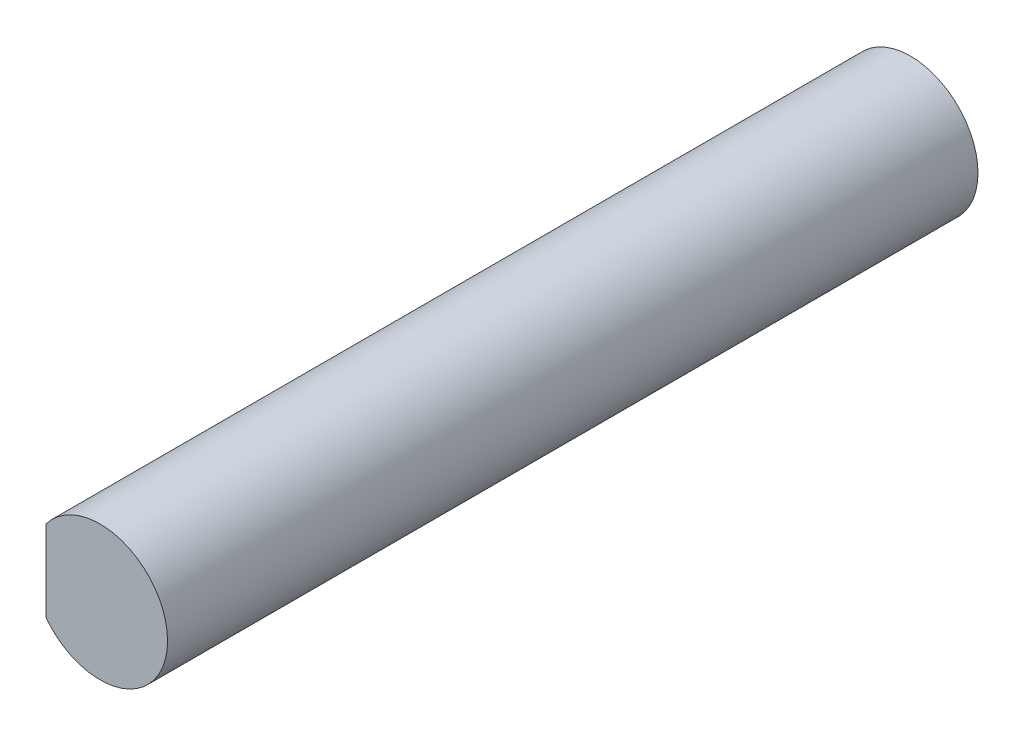
ISO-10303-21;
HEADER;
FILE_DESCRIPTION(('STEP AP214'),'2;1');
FILE_NAME('part.step','',(''),(''),'','','');
FILE_SCHEMA(('AUTOMOTIVE_DESIGN { 1 0 10303 214 1 1 1 1 }'));
ENDSEC;
DATA;
#1=APPLICATION_CONTEXT('core data for automotive mechanical design processes');
#2=APPLICATION_PROTOCOL_DEFINITION('international standard','automotive_design',2000,#1);
#3=PRODUCT_CONTEXT('',#1,'mechanical');
#4=PRODUCT('Part','Part','',(#3));
#5=PRODUCT_RELATED_PRODUCT_CATEGORY('part','',(#4));
#6=PRODUCT_DEFINITION_FORMATION('','',#4);
#7=PRODUCT_DEFINITION_CONTEXT('part definition',#1,'design');
#8=PRODUCT_DEFINITION('design','',#6,#7);
#9=PRODUCT_DEFINITION_SHAPE('','',#8);
#10=(LENGTH_UNIT() NAMED_UNIT(*) SI_UNIT(.MILLI.,.METRE.));
#11=(NAMED_UNIT(*) PLANE_ANGLE_UNIT() SI_UNIT($,.RADIAN.));
#12=(NAMED_UNIT(*) SI_UNIT($,.STERADIAN.) SOLID_ANGLE_UNIT());
#13=UNCERTAINTY_MEASURE_WITH_UNIT(LENGTH_MEASURE(1.E-05),#10,'distance_accuracy_value','');
#14=(GEOMETRIC_REPRESENTATION_CONTEXT(3) GLOBAL_UNCERTAINTY_ASSIGNED_CONTEXT((#13)) GLOBAL_UNIT_ASSIGNED_CONTEXT((#10,
#11,#12)) REPRESENTATION_CONTEXT('',''));
#15=CARTESIAN_POINT('',(0.,0.,0.));
#16=DIRECTION('',(0.,0.,1.));
#17=DIRECTION('',(1.,0.,0.));
#18=AXIS2_PLACEMENT_3D('',#15,#16,#17);
#19=CARTESIAN_POINT('',(0.,0.,70.));
#20=DIRECTION('',(0.,0.,-1.));
#21=DIRECTION('',(-1.,0.,0.));
#22=AXIS2_PLACEMENT_3D('',#19,#20,#21);
#23=CYLINDRICAL_SURFACE('',#22,5.);
#24=CARTESIAN_POINT('',(0.,0.,70.));
#25=DIRECTION('',(0.,0.,1.));
#26=DIRECTION('',(1.,0.,0.));
#27=AXIS2_PLACEMENT_3D('',#24,#25,#26);
#28=CIRCLE('',#27,5.);
#29=CARTESIAN_POINT('',(-4.,-3.,70.));
#30=VERTEX_POINT('',#29);
#31=CARTESIAN_POINT('',(-4.,3.,70.));
#32=VERTEX_POINT('',#31);
#33=EDGE_CURVE('E11',#30,#32,#28,.T.);
#34=ORIENTED_EDGE('',*,*,#33,.F.);
#35=DIRECTION('',(0.,0.,1.));
#36=VECTOR('',#35,1.);
#37=CARTESIAN_POINT('',(-4.,-3.,63.));
#38=LINE('',#37,#36);
#39=CARTESIAN_POINT('',(-4.,-3.,63.));
#40=VERTEX_POINT('',#39);
#41=EDGE_CURVE('E51',#40,#30,#38,.T.);
#42=ORIENTED_EDGE('',*,*,#41,.F.);
#43=CARTESIAN_POINT('',(0.,0.,63.));
#44=DIRECTION('',(0.,0.,1.));
#45=DIRECTION('',(1.,0.,0.));
#46=AXIS2_PLACEMENT_3D('',#43,#44,#45);
#47=CIRCLE('',#46,5.);
#48=CARTESIAN_POINT('',(-4.,3.,63.));
#49=VERTEX_POINT('',#48);
#50=EDGE_CURVE('E66',#49,#40,#47,.T.);
#51=ORIENTED_EDGE('',*,*,#50,.F.);
#52=DIRECTION('',(0.,0.,1.));
#53=VECTOR('',#52,1.);
#54=CARTESIAN_POINT('',(-4.,3.,63.));
#55=LINE('',#54,#53);
#56=EDGE_CURVE('E57',#49,#32,#55,.T.);
#57=ORIENTED_EDGE('',*,*,#56,.T.);
#58=EDGE_LOOP('',(#34,#42,#51,#57));
#59=FACE_BOUND('',#58,.T.);
#60=CARTESIAN_POINT('',(0.,0.,10.));
#61=DIRECTION('',(0.,0.,1.));
#62=DIRECTION('',(1.,0.,0.));
#63=AXIS2_PLACEMENT_3D('',#60,#61,#62);
#64=CIRCLE('',#63,5.);
#65=CARTESIAN_POINT('',(5.,0.,10.));
#66=VERTEX_POINT('',#65);
#67=EDGE_CURVE('E40',#66,#66,#64,.T.);
#68=ORIENTED_EDGE('',*,*,#67,.T.);
#69=EDGE_LOOP('',(#68));
#70=FACE_BOUND('',#69,.T.);
#71=ADVANCED_FACE('F37',(#59,#70),#23,.T.);
#72=CARTESIAN_POINT('',(0.,0.,70.));
#73=DIRECTION('',(0.,0.,1.));
#74=DIRECTION('',(1.,0.,0.));
#75=AXIS2_PLACEMENT_3D('',#72,#73,#74);
#76=PLANE('',#75);
#77=DIRECTION('',(0.,1.,0.));
#78=VECTOR('',#77,1.);
#79=CARTESIAN_POINT('',(-4.,3.,70.));
#80=LINE('',#79,#78);
#81=EDGE_CURVE('E62',#30,#32,#80,.T.);
#82=ORIENTED_EDGE('',*,*,#81,.F.);
#83=ORIENTED_EDGE('',*,*,#33,.T.);
#84=EDGE_LOOP('',(#82,#83));
#85=FACE_BOUND('',#84,.T.);
#86=ADVANCED_FACE('F72',(#85),#76,.T.);
#87=CARTESIAN_POINT('',(0.,0.,10.));
#88=DIRECTION('',(0.,0.,1.));
#89=DIRECTION('',(1.,0.,0.));
#90=AXIS2_PLACEMENT_3D('',#87,#88,#89);
#91=PLANE('',#90);
#92=ORIENTED_EDGE('',*,*,#67,.F.);
#93=EDGE_LOOP('',(#92));
#94=FACE_BOUND('',#93,.T.);
#95=ADVANCED_FACE('F74',(#94),#91,.F.);
#96=CARTESIAN_POINT('',(-4.,3.,63.));
#97=DIRECTION('',(1.,0.,0.));
#98=DIRECTION('',(0.,0.,-1.));
#99=AXIS2_PLACEMENT_3D('',#96,#97,#98);
#100=PLANE('',#99);
#101=ORIENTED_EDGE('',*,*,#81,.T.);
#102=ORIENTED_EDGE('',*,*,#56,.F.);
#103=DIRECTION('',(0.,1.,0.));
#104=VECTOR('',#103,1.);
#105=CARTESIAN_POINT('',(-4.,3.,63.));
#106=LINE('',#105,#104);
#107=EDGE_CURVE('E89',#40,#49,#106,.T.);
#108=ORIENTED_EDGE('',*,*,#107,.F.);
#109=ORIENTED_EDGE('',*,*,#41,.T.);
#110=EDGE_LOOP('',(#101,#102,#108,#109));
#111=FACE_BOUND('',#110,.T.);
#112=ADVANCED_FACE('F63',(#111),#100,.F.);
#113=CARTESIAN_POINT('',(0.,0.,63.));
#114=DIRECTION('',(0.,0.,1.));
#115=DIRECTION('',(1.,0.,0.));
#116=AXIS2_PLACEMENT_3D('',#113,#114,#115);
#117=PLANE('',#116);
#118=ORIENTED_EDGE('',*,*,#50,.T.);
#119=ORIENTED_EDGE('',*,*,#107,.T.);
#120=EDGE_LOOP('',(#118,#119));
#121=FACE_BOUND('',#120,.T.);
#122=ADVANCED_FACE('F84',(#121),#117,.T.);
#123=CLOSED_SHELL('',(#71,#86,#95,#112,#122));
#124=MANIFOLD_SOLID_BREP('B2',#123);
#125=ADVANCED_BREP_SHAPE_REPRESENTATION('',(#18,#124),#14);
#126=SHAPE_DEFINITION_REPRESENTATION(#9,#125);
ENDSEC;
END-ISO-10303-21;
